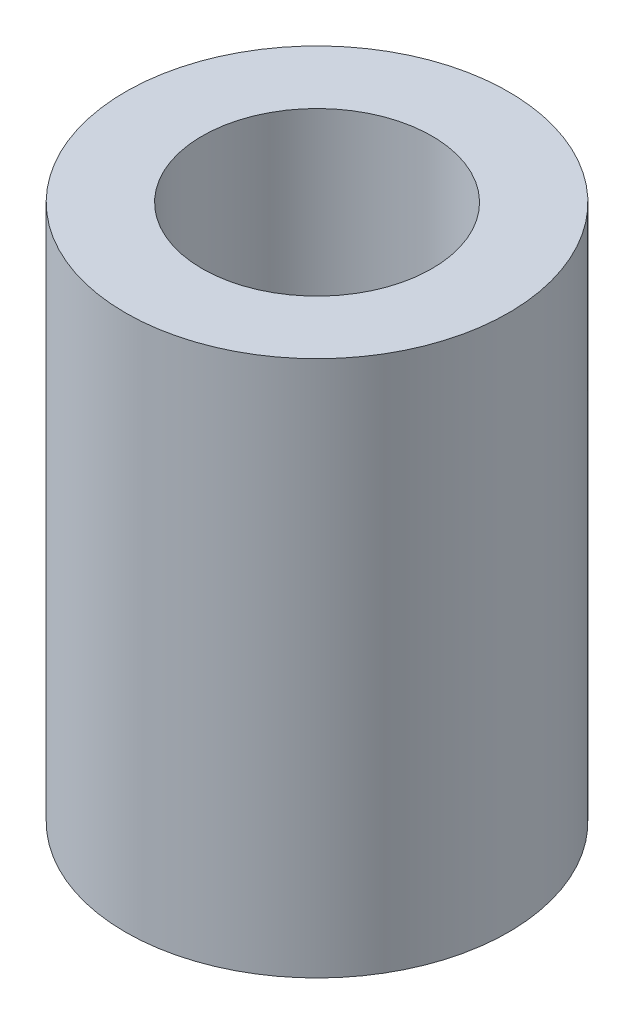
ISO-10303-21;
HEADER;
FILE_DESCRIPTION(('STEP AP214'),'2;1');
FILE_NAME('part.step','',(''),(''),'','','');
FILE_SCHEMA(('AUTOMOTIVE_DESIGN { 1 0 10303 214 1 1 1 1 }'));
ENDSEC;
DATA;
#1=APPLICATION_CONTEXT('core data for automotive mechanical design processes');
#2=APPLICATION_PROTOCOL_DEFINITION('international standard','automotive_design',2000,#1);
#3=PRODUCT_CONTEXT('',#1,'mechanical');
#4=PRODUCT('Part','Part','',(#3));
#5=PRODUCT_RELATED_PRODUCT_CATEGORY('part','',(#4));
#6=PRODUCT_DEFINITION_FORMATION('','',#4);
#7=PRODUCT_DEFINITION_CONTEXT('part definition',#1,'design');
#8=PRODUCT_DEFINITION('design','',#6,#7);
#9=PRODUCT_DEFINITION_SHAPE('','',#8);
#10=(LENGTH_UNIT() NAMED_UNIT(*) SI_UNIT(.MILLI.,.METRE.));
#11=(NAMED_UNIT(*) PLANE_ANGLE_UNIT() SI_UNIT($,.RADIAN.));
#12=(NAMED_UNIT(*) SI_UNIT($,.STERADIAN.) SOLID_ANGLE_UNIT());
#13=UNCERTAINTY_MEASURE_WITH_UNIT(LENGTH_MEASURE(1.E-05),#10,'distance_accuracy_value','');
#14=(GEOMETRIC_REPRESENTATION_CONTEXT(3) GLOBAL_UNCERTAINTY_ASSIGNED_CONTEXT((#13)) GLOBAL_UNIT_ASSIGNED_CONTEXT((#10,
#11,#12)) REPRESENTATION_CONTEXT('',''));
#15=CARTESIAN_POINT('',(0.,0.,0.));
#16=DIRECTION('',(0.,0.,1.));
#17=DIRECTION('',(1.,0.,0.));
#18=AXIS2_PLACEMENT_3D('',#15,#16,#17);
#19=CARTESIAN_POINT('',(0.,7.,0.));
#20=DIRECTION('',(0.,1.,0.));
#21=DIRECTION('',(0.,0.,1.));
#22=AXIS2_PLACEMENT_3D('',#19,#20,#21);
#23=PLANE('',#22);
#24=CARTESIAN_POINT('',(0.,7.,0.));
#25=DIRECTION('',(0.,1.,0.));
#26=DIRECTION('',(0.,0.,1.));
#27=AXIS2_PLACEMENT_3D('',#24,#25,#26);
#28=CIRCLE('',#27,2.5);
#29=CARTESIAN_POINT('',(0.,7.,2.5));
#30=VERTEX_POINT('',#29);
#31=EDGE_CURVE('E10',#30,#30,#28,.T.);
#32=ORIENTED_EDGE('',*,*,#31,.T.);
#33=EDGE_LOOP('',(#32));
#34=FACE_BOUND('',#33,.T.);
#35=CARTESIAN_POINT('',(0.,7.,0.));
#36=DIRECTION('',(0.,1.,0.));
#37=DIRECTION('',(0.,0.,1.));
#38=AXIS2_PLACEMENT_3D('',#35,#36,#37);
#39=CIRCLE('',#38,1.5);
#40=CARTESIAN_POINT('',(0.,7.,1.5));
#41=VERTEX_POINT('',#40);
#42=EDGE_CURVE('E46',#41,#41,#39,.T.);
#43=ORIENTED_EDGE('',*,*,#42,.F.);
#44=EDGE_LOOP('',(#43));
#45=FACE_BOUND('',#44,.T.);
#46=ADVANCED_FACE('F35',(#34,#45),#23,.T.);
#47=CARTESIAN_POINT('',(0.,0.,0.));
#48=DIRECTION('',(0.,1.,0.));
#49=DIRECTION('',(0.,0.,1.));
#50=AXIS2_PLACEMENT_3D('',#47,#48,#49);
#51=PLANE('',#50);
#52=CARTESIAN_POINT('',(0.,0.,0.));
#53=DIRECTION('',(0.,1.,0.));
#54=DIRECTION('',(0.,0.,1.));
#55=AXIS2_PLACEMENT_3D('',#52,#53,#54);
#56=CIRCLE('',#55,2.5);
#57=CARTESIAN_POINT('',(0.,0.,2.5));
#58=VERTEX_POINT('',#57);
#59=EDGE_CURVE('E39',#58,#58,#56,.T.);
#60=ORIENTED_EDGE('',*,*,#59,.F.);
#61=EDGE_LOOP('',(#60));
#62=FACE_BOUND('',#61,.T.);
#63=CARTESIAN_POINT('',(0.,0.,0.));
#64=DIRECTION('',(0.,1.,0.));
#65=DIRECTION('',(0.,0.,1.));
#66=AXIS2_PLACEMENT_3D('',#63,#64,#65);
#67=CIRCLE('',#66,1.5);
#68=CARTESIAN_POINT('',(0.,0.,1.5));
#69=VERTEX_POINT('',#68);
#70=EDGE_CURVE('E48',#69,#69,#67,.T.);
#71=ORIENTED_EDGE('',*,*,#70,.T.);
#72=EDGE_LOOP('',(#71));
#73=FACE_BOUND('',#72,.T.);
#74=ADVANCED_FACE('F58',(#62,#73),#51,.F.);
#75=CARTESIAN_POINT('',(0.,7.,0.));
#76=DIRECTION('',(0.,-1.,0.));
#77=DIRECTION('',(0.,0.,-1.));
#78=AXIS2_PLACEMENT_3D('',#75,#76,#77);
#79=CYLINDRICAL_SURFACE('',#78,2.5);
#80=ORIENTED_EDGE('',*,*,#31,.F.);
#81=EDGE_LOOP('',(#80));
#82=FACE_BOUND('',#81,.T.);
#83=ORIENTED_EDGE('',*,*,#59,.T.);
#84=EDGE_LOOP('',(#83));
#85=FACE_BOUND('',#84,.T.);
#86=ADVANCED_FACE('F37',(#82,#85),#79,.T.);
#87=CARTESIAN_POINT('',(0.,7.,0.));
#88=DIRECTION('',(0.,-1.,0.));
#89=DIRECTION('',(0.,0.,-1.));
#90=AXIS2_PLACEMENT_3D('',#87,#88,#89);
#91=CYLINDRICAL_SURFACE('',#90,1.5);
#92=ORIENTED_EDGE('',*,*,#42,.T.);
#93=EDGE_LOOP('',(#92));
#94=FACE_BOUND('',#93,.T.);
#95=ORIENTED_EDGE('',*,*,#70,.F.);
#96=EDGE_LOOP('',(#95));
#97=FACE_BOUND('',#96,.T.);
#98=ADVANCED_FACE('F54',(#94,#97),#91,.F.);
#99=CLOSED_SHELL('',(#46,#74,#86,#98));
#100=MANIFOLD_SOLID_BREP('B2',#99);
#101=ADVANCED_BREP_SHAPE_REPRESENTATION('',(#18,#100),#14);
#102=SHAPE_DEFINITION_REPRESENTATION(#9,#101);
ENDSEC;
END-ISO-10303-21;
